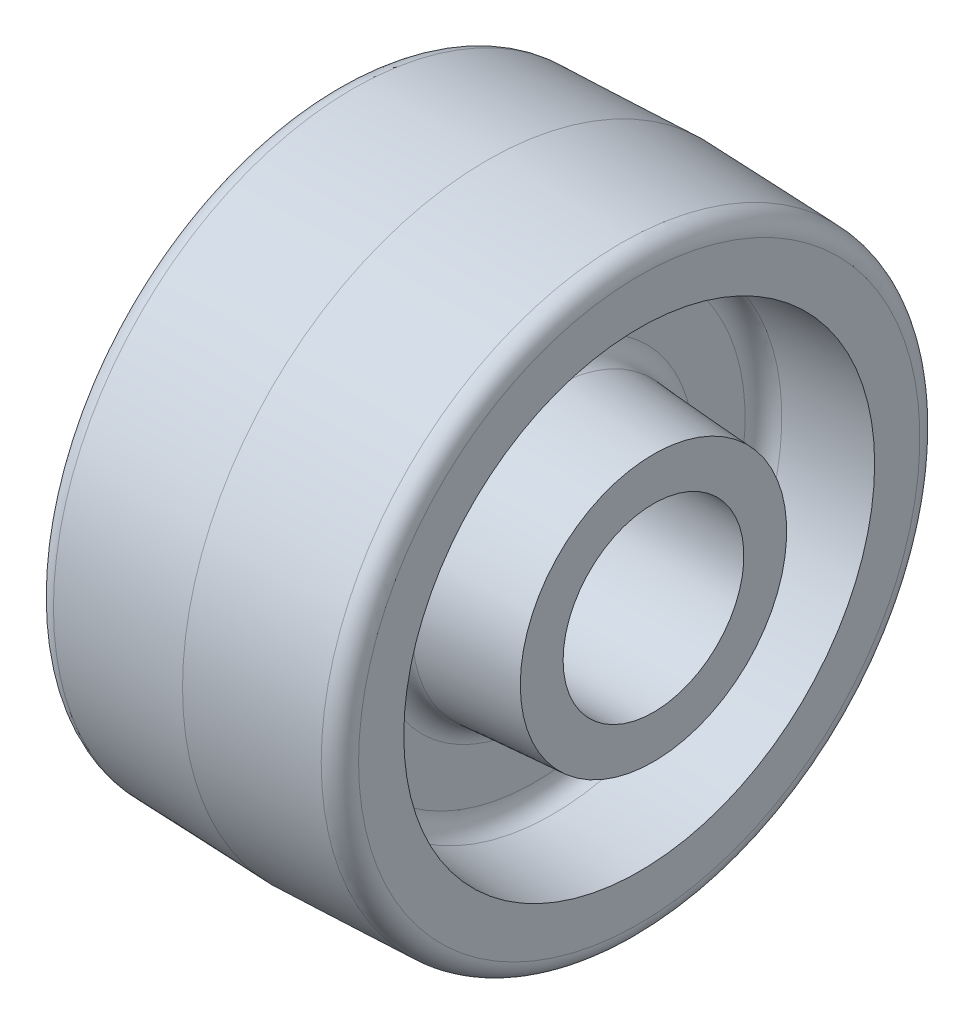
ISO-10303-21;
HEADER;
FILE_DESCRIPTION(('STEP AP214'),'2;1');
FILE_NAME('part.step','',(''),(''),'','','');
FILE_SCHEMA(('AUTOMOTIVE_DESIGN { 1 0 10303 214 1 1 1 1 }'));
ENDSEC;
DATA;
#1=APPLICATION_CONTEXT('core data for automotive mechanical design processes');
#2=APPLICATION_PROTOCOL_DEFINITION('international standard','automotive_design',2000,#1);
#3=PRODUCT_CONTEXT('',#1,'mechanical');
#4=PRODUCT('Part','Part','',(#3));
#5=PRODUCT_RELATED_PRODUCT_CATEGORY('part','',(#4));
#6=PRODUCT_DEFINITION_FORMATION('','',#4);
#7=PRODUCT_DEFINITION_CONTEXT('part definition',#1,'design');
#8=PRODUCT_DEFINITION('design','',#6,#7);
#9=PRODUCT_DEFINITION_SHAPE('','',#8);
#10=(LENGTH_UNIT() NAMED_UNIT(*) SI_UNIT(.MILLI.,.METRE.));
#11=(NAMED_UNIT(*) PLANE_ANGLE_UNIT() SI_UNIT($,.RADIAN.));
#12=(NAMED_UNIT(*) SI_UNIT($,.STERADIAN.) SOLID_ANGLE_UNIT());
#13=UNCERTAINTY_MEASURE_WITH_UNIT(LENGTH_MEASURE(1.E-05),#10,'distance_accuracy_value','');
#14=(GEOMETRIC_REPRESENTATION_CONTEXT(3) GLOBAL_UNCERTAINTY_ASSIGNED_CONTEXT((#13)) GLOBAL_UNIT_ASSIGNED_CONTEXT((#10,
#11,#12)) REPRESENTATION_CONTEXT('',''));
#15=CARTESIAN_POINT('',(0.,0.,0.));
#16=DIRECTION('',(0.,0.,1.));
#17=DIRECTION('',(1.,0.,0.));
#18=AXIS2_PLACEMENT_3D('',#15,#16,#17);
#19=CARTESIAN_POINT('',(27.78125,22.225,0.));
#20=DIRECTION('',(-1.,0.,0.));
#21=DIRECTION('',(0.,0.,1.));
#22=AXIS2_PLACEMENT_3D('',#19,#20,#21);
#23=PLANE('',#22);
#24=CARTESIAN_POINT('',(27.78125,0.,0.));
#25=DIRECTION('',(-1.,0.,0.));
#26=DIRECTION('',(0.,0.,1.));
#27=AXIS2_PLACEMENT_3D('',#24,#25,#26);
#28=CIRCLE('',#27,15.08125);
#29=CARTESIAN_POINT('',(27.78125,0.,15.08125));
#30=VERTEX_POINT('',#29);
#31=EDGE_CURVE('E89',#30,#30,#28,.F.);
#32=ORIENTED_EDGE('',*,*,#31,.F.);
#33=EDGE_LOOP('',(#32));
#34=FACE_BOUND('',#33,.T.);
#35=CARTESIAN_POINT('',(27.78125,0.,0.));
#36=DIRECTION('',(-1.,0.,0.));
#37=DIRECTION('',(0.,0.,1.));
#38=AXIS2_PLACEMENT_3D('',#35,#36,#37);
#39=CIRCLE('',#38,22.225);
#40=CARTESIAN_POINT('',(27.78125,0.,22.225));
#41=VERTEX_POINT('',#40);
#42=EDGE_CURVE('E10',#41,#41,#39,.T.);
#43=ORIENTED_EDGE('',*,*,#42,.F.);
#44=EDGE_LOOP('',(#43));
#45=FACE_BOUND('',#44,.T.);
#46=ADVANCED_FACE('F31',(#34,#45),#23,.F.);
#47=CARTESIAN_POINT('',(27.78125,0.,0.));
#48=DIRECTION('',(-1.,0.,0.));
#49=DIRECTION('',(0.,0.,1.));
#50=AXIS2_PLACEMENT_3D('',#47,#48,#49);
#51=CONICAL_SURFACE('',#50,22.225,0.0677187749773543);
#52=CARTESIAN_POINT('',(10.89765718287,0.,0.));
#53=DIRECTION('',(-1.,0.,0.));
#54=DIRECTION('',(0.,0.,1.));
#55=AXIS2_PLACEMENT_3D('',#52,#53,#54);
#56=CIRCLE('',#55,23.370087150778);
#57=CARTESIAN_POINT('',(10.89765718287,0.,23.370087150778));
#58=VERTEX_POINT('',#57);
#59=EDGE_CURVE('E38',#58,#58,#56,.T.);
#60=ORIENTED_EDGE('',*,*,#59,.F.);
#61=EDGE_LOOP('',(#60));
#62=FACE_BOUND('',#61,.T.);
#63=ORIENTED_EDGE('',*,*,#42,.T.);
#64=EDGE_LOOP('',(#63));
#65=FACE_BOUND('',#64,.T.);
#66=ADVANCED_FACE('F191',(#62,#65),#51,.T.);
#67=CARTESIAN_POINT('',(11.1125000000004,0.,0.));
#68=DIRECTION('',(-1.,0.,0.));
#69=DIRECTION('',(0.,0.,1.));
#70=AXIS2_PLACEMENT_3D('',#67,#68,#69);
#71=TOROIDAL_SURFACE('',#70,26.5378099233592,3.17500000000036);
#72=CARTESIAN_POINT('',(7.9375,0.,0.));
#73=DIRECTION('',(-1.,0.,0.));
#74=DIRECTION('',(0.,0.,1.));
#75=AXIS2_PLACEMENT_3D('',#72,#73,#74);
#76=CIRCLE('',#75,26.537809923359);
#77=CARTESIAN_POINT('',(7.9375,0.,26.537809923359));
#78=VERTEX_POINT('',#77);
#79=EDGE_CURVE('E42',#78,#78,#76,.T.);
#80=ORIENTED_EDGE('',*,*,#79,.F.);
#81=EDGE_LOOP('',(#80));
#82=FACE_BOUND('',#81,.T.);
#83=ORIENTED_EDGE('',*,*,#59,.T.);
#84=EDGE_LOOP('',(#83));
#85=FACE_BOUND('',#84,.T.);
#86=ADVANCED_FACE('F185',(#82,#85),#71,.F.);
#87=CARTESIAN_POINT('',(7.9375,35.133042431313,0.));
#88=DIRECTION('',(-1.,0.,0.));
#89=DIRECTION('',(0.,0.,1.));
#90=AXIS2_PLACEMENT_3D('',#87,#88,#89);
#91=PLANE('',#90);
#92=CARTESIAN_POINT('',(7.9375,0.,0.));
#93=DIRECTION('',(-1.,0.,0.));
#94=DIRECTION('',(0.,0.,1.));
#95=AXIS2_PLACEMENT_3D('',#92,#93,#94);
#96=CIRCLE('',#95,35.133042431313);
#97=CARTESIAN_POINT('',(7.9375,0.,35.133042431313));
#98=VERTEX_POINT('',#97);
#99=EDGE_CURVE('E47',#98,#98,#96,.T.);
#100=ORIENTED_EDGE('',*,*,#99,.F.);
#101=EDGE_LOOP('',(#100));
#102=FACE_BOUND('',#101,.T.);
#103=ORIENTED_EDGE('',*,*,#79,.T.);
#104=EDGE_LOOP('',(#103));
#105=FACE_BOUND('',#104,.T.);
#106=ADVANCED_FACE('F179',(#102,#105),#91,.F.);
#107=CARTESIAN_POINT('',(11.1125000000004,0.,0.));
#108=DIRECTION('',(-1.,0.,0.));
#109=DIRECTION('',(0.,0.,1.));
#110=AXIS2_PLACEMENT_3D('',#107,#108,#109);
#111=TOROIDAL_SURFACE('',#110,35.1330424313128,3.17500000000036);
#112=CARTESIAN_POINT('',(10.89765718287,0.,0.));
#113=DIRECTION('',(-1.,0.,0.));
#114=DIRECTION('',(0.,0.,1.));
#115=AXIS2_PLACEMENT_3D('',#112,#113,#114);
#116=CIRCLE('',#115,38.300765203894);
#117=CARTESIAN_POINT('',(10.89765718287,0.,38.300765203894));
#118=VERTEX_POINT('',#117);
#119=EDGE_CURVE('E50',#118,#118,#116,.T.);
#120=ORIENTED_EDGE('',*,*,#119,.F.);
#121=EDGE_LOOP('',(#120));
#122=FACE_BOUND('',#121,.T.);
#123=ORIENTED_EDGE('',*,*,#99,.T.);
#124=EDGE_LOOP('',(#123));
#125=FACE_BOUND('',#124,.T.);
#126=ADVANCED_FACE('F173',(#122,#125),#111,.F.);
#127=CARTESIAN_POINT('',(10.89765718287,0.,0.));
#128=DIRECTION('',(1.,0.,0.));
#129=DIRECTION('',(0.,0.,-1.));
#130=AXIS2_PLACEMENT_3D('',#127,#128,#129);
#131=CONICAL_SURFACE('',#130,38.300765203894,0.0677187749773266);
#132=CARTESIAN_POINT('',(25.4,0.,0.));
#133=DIRECTION('',(-1.,0.,0.));
#134=DIRECTION('',(0.,0.,1.));
#135=AXIS2_PLACEMENT_3D('',#132,#133,#134);
#136=CIRCLE('',#135,39.284350072111);
#137=CARTESIAN_POINT('',(25.4,0.,39.284350072111));
#138=VERTEX_POINT('',#137);
#139=EDGE_CURVE('E53',#138,#138,#136,.T.);
#140=ORIENTED_EDGE('',*,*,#139,.F.);
#141=EDGE_LOOP('',(#140));
#142=FACE_BOUND('',#141,.T.);
#143=ORIENTED_EDGE('',*,*,#119,.T.);
#144=EDGE_LOOP('',(#143));
#145=FACE_BOUND('',#144,.T.);
#146=ADVANCED_FACE('F167',(#142,#145),#131,.F.);
#147=CARTESIAN_POINT('',(25.4,46.827433348469,0.));
#148=DIRECTION('',(-1.,0.,0.));
#149=DIRECTION('',(0.,0.,1.));
#150=AXIS2_PLACEMENT_3D('',#147,#148,#149);
#151=PLANE('',#150);
#152=CARTESIAN_POINT('',(25.4,0.,0.));
#153=DIRECTION('',(-1.,0.,0.));
#154=DIRECTION('',(0.,0.,1.));
#155=AXIS2_PLACEMENT_3D('',#152,#153,#154);
#156=CIRCLE('',#155,46.827433348469);
#157=CARTESIAN_POINT('',(25.4,0.,46.827433348469));
#158=VERTEX_POINT('',#157);
#159=EDGE_CURVE('E56',#158,#158,#156,.T.);
#160=ORIENTED_EDGE('',*,*,#159,.F.);
#161=EDGE_LOOP('',(#160));
#162=FACE_BOUND('',#161,.T.);
#163=ORIENTED_EDGE('',*,*,#139,.T.);
#164=EDGE_LOOP('',(#163));
#165=FACE_BOUND('',#164,.T.);
#166=ADVANCED_FACE('F161',(#162,#165),#151,.F.);
#167=CARTESIAN_POINT('',(22.2249999999989,0.,0.));
#168=DIRECTION('',(-1.,0.,0.));
#169=DIRECTION('',(0.,0.,1.));
#170=AXIS2_PLACEMENT_3D('',#167,#168,#169);
#171=TOROIDAL_SURFACE('',#170,46.8274333484679,3.1750000000011);
#172=CARTESIAN_POINT('',(22.338574881833,0.,0.));
#173=DIRECTION('',(-1.,0.,0.));
#174=DIRECTION('',(0.,0.,1.));
#175=AXIS2_PLACEMENT_3D('',#172,#173,#174);
#176=CIRCLE('',#175,50.000401319662);
#177=CARTESIAN_POINT('',(22.338574881833,0.,50.000401319662));
#178=VERTEX_POINT('',#177);
#179=EDGE_CURVE('E59',#178,#178,#176,.T.);
#180=ORIENTED_EDGE('',*,*,#179,.F.);
#181=EDGE_LOOP('',(#180));
#182=FACE_BOUND('',#181,.T.);
#183=ORIENTED_EDGE('',*,*,#159,.T.);
#184=EDGE_LOOP('',(#183));
#185=FACE_BOUND('',#184,.T.);
#186=ADVANCED_FACE('F155',(#182,#185),#171,.T.);
#187=CARTESIAN_POINT('',(22.338574881833,0.,0.));
#188=DIRECTION('',(-1.,0.,0.));
#189=DIRECTION('',(0.,0.,1.));
#190=AXIS2_PLACEMENT_3D('',#187,#188,#189);
#191=CONICAL_SURFACE('',#190,50.000401319662,0.0357792496658724);
#192=CARTESIAN_POINT('',(0.,0.,0.));
#193=DIRECTION('',(-1.,0.,0.));
#194=DIRECTION('',(0.,0.,1.));
#195=AXIS2_PLACEMENT_3D('',#192,#193,#194);
#196=CIRCLE('',#195,50.8);
#197=CARTESIAN_POINT('',(0.,0.,50.8));
#198=VERTEX_POINT('',#197);
#199=EDGE_CURVE('E62',#198,#198,#196,.T.);
#200=ORIENTED_EDGE('',*,*,#199,.F.);
#201=EDGE_LOOP('',(#200));
#202=FACE_BOUND('',#201,.T.);
#203=ORIENTED_EDGE('',*,*,#179,.T.);
#204=EDGE_LOOP('',(#203));
#205=FACE_BOUND('',#204,.T.);
#206=ADVANCED_FACE('F149',(#202,#205),#191,.T.);
#207=CARTESIAN_POINT('',(0.,0.,0.));
#208=DIRECTION('',(1.,0.,0.));
#209=DIRECTION('',(0.,0.,-1.));
#210=AXIS2_PLACEMENT_3D('',#207,#208,#209);
#211=CONICAL_SURFACE('',#210,50.8,0.0357792496658724);
#212=CARTESIAN_POINT('',(-22.338574881833,0.,0.));
#213=DIRECTION('',(-1.,0.,0.));
#214=DIRECTION('',(0.,0.,1.));
#215=AXIS2_PLACEMENT_3D('',#212,#213,#214);
#216=CIRCLE('',#215,50.000401319662);
#217=CARTESIAN_POINT('',(-22.338574881833,0.,50.000401319662));
#218=VERTEX_POINT('',#217);
#219=EDGE_CURVE('E65',#218,#218,#216,.T.);
#220=ORIENTED_EDGE('',*,*,#219,.F.);
#221=EDGE_LOOP('',(#220));
#222=FACE_BOUND('',#221,.T.);
#223=ORIENTED_EDGE('',*,*,#199,.T.);
#224=EDGE_LOOP('',(#223));
#225=FACE_BOUND('',#224,.T.);
#226=ADVANCED_FACE('F143',(#222,#225),#211,.T.);
#227=CARTESIAN_POINT('',(-22.2249999999989,0.,0.));
#228=DIRECTION('',(-1.,0.,0.));
#229=DIRECTION('',(0.,0.,1.));
#230=AXIS2_PLACEMENT_3D('',#227,#228,#229);
#231=TOROIDAL_SURFACE('',#230,46.8274333484679,3.1750000000011);
#232=CARTESIAN_POINT('',(-25.4,0.,0.));
#233=DIRECTION('',(-1.,0.,0.));
#234=DIRECTION('',(0.,0.,1.));
#235=AXIS2_PLACEMENT_3D('',#232,#233,#234);
#236=CIRCLE('',#235,46.827433348469);
#237=CARTESIAN_POINT('',(-25.4,0.,46.827433348469));
#238=VERTEX_POINT('',#237);
#239=EDGE_CURVE('E68',#238,#238,#236,.T.);
#240=ORIENTED_EDGE('',*,*,#239,.F.);
#241=EDGE_LOOP('',(#240));
#242=FACE_BOUND('',#241,.T.);
#243=ORIENTED_EDGE('',*,*,#219,.T.);
#244=EDGE_LOOP('',(#243));
#245=FACE_BOUND('',#244,.T.);
#246=ADVANCED_FACE('F137',(#242,#245),#231,.T.);
#247=CARTESIAN_POINT('',(-25.4,39.284350072111,0.));
#248=DIRECTION('',(1.,0.,0.));
#249=DIRECTION('',(0.,0.,-1.));
#250=AXIS2_PLACEMENT_3D('',#247,#248,#249);
#251=PLANE('',#250);
#252=CARTESIAN_POINT('',(-25.4,0.,0.));
#253=DIRECTION('',(-1.,0.,0.));
#254=DIRECTION('',(0.,0.,1.));
#255=AXIS2_PLACEMENT_3D('',#252,#253,#254);
#256=CIRCLE('',#255,39.284350072111);
#257=CARTESIAN_POINT('',(-25.4,0.,39.284350072111));
#258=VERTEX_POINT('',#257);
#259=EDGE_CURVE('E71',#258,#258,#256,.T.);
#260=ORIENTED_EDGE('',*,*,#259,.F.);
#261=EDGE_LOOP('',(#260));
#262=FACE_BOUND('',#261,.T.);
#263=ORIENTED_EDGE('',*,*,#239,.T.);
#264=EDGE_LOOP('',(#263));
#265=FACE_BOUND('',#264,.T.);
#266=ADVANCED_FACE('F131',(#262,#265),#251,.F.);
#267=CARTESIAN_POINT('',(-25.4,0.,0.));
#268=DIRECTION('',(-1.,0.,0.));
#269=DIRECTION('',(0.,0.,1.));
#270=AXIS2_PLACEMENT_3D('',#267,#268,#269);
#271=CONICAL_SURFACE('',#270,39.284350072111,0.0677187749773266);
#272=CARTESIAN_POINT('',(-10.89765718287,0.,0.));
#273=DIRECTION('',(-1.,0.,0.));
#274=DIRECTION('',(0.,0.,1.));
#275=AXIS2_PLACEMENT_3D('',#272,#273,#274);
#276=CIRCLE('',#275,38.300765203894);
#277=CARTESIAN_POINT('',(-10.89765718287,0.,38.300765203894));
#278=VERTEX_POINT('',#277);
#279=EDGE_CURVE('E74',#278,#278,#276,.T.);
#280=ORIENTED_EDGE('',*,*,#279,.F.);
#281=EDGE_LOOP('',(#280));
#282=FACE_BOUND('',#281,.T.);
#283=ORIENTED_EDGE('',*,*,#259,.T.);
#284=EDGE_LOOP('',(#283));
#285=FACE_BOUND('',#284,.T.);
#286=ADVANCED_FACE('F125',(#282,#285),#271,.F.);
#287=CARTESIAN_POINT('',(-11.1125000000004,0.,0.));
#288=DIRECTION('',(-1.,0.,0.));
#289=DIRECTION('',(0.,0.,1.));
#290=AXIS2_PLACEMENT_3D('',#287,#288,#289);
#291=TOROIDAL_SURFACE('',#290,35.1330424313128,3.17500000000036);
#292=CARTESIAN_POINT('',(-7.9375,0.,0.));
#293=DIRECTION('',(-1.,0.,0.));
#294=DIRECTION('',(0.,0.,1.));
#295=AXIS2_PLACEMENT_3D('',#292,#293,#294);
#296=CIRCLE('',#295,35.133042431313);
#297=CARTESIAN_POINT('',(-7.9375,0.,35.133042431313));
#298=VERTEX_POINT('',#297);
#299=EDGE_CURVE('E77',#298,#298,#296,.T.);
#300=ORIENTED_EDGE('',*,*,#299,.F.);
#301=EDGE_LOOP('',(#300));
#302=FACE_BOUND('',#301,.T.);
#303=ORIENTED_EDGE('',*,*,#279,.T.);
#304=EDGE_LOOP('',(#303));
#305=FACE_BOUND('',#304,.T.);
#306=ADVANCED_FACE('F119',(#302,#305),#291,.F.);
#307=CARTESIAN_POINT('',(-7.9375,26.537809923359,0.));
#308=DIRECTION('',(1.,0.,0.));
#309=DIRECTION('',(0.,0.,-1.));
#310=AXIS2_PLACEMENT_3D('',#307,#308,#309);
#311=PLANE('',#310);
#312=CARTESIAN_POINT('',(-7.9375,0.,0.));
#313=DIRECTION('',(-1.,0.,0.));
#314=DIRECTION('',(0.,0.,1.));
#315=AXIS2_PLACEMENT_3D('',#312,#313,#314);
#316=CIRCLE('',#315,26.537809923359);
#317=CARTESIAN_POINT('',(-7.9375,0.,26.537809923359));
#318=VERTEX_POINT('',#317);
#319=EDGE_CURVE('E80',#318,#318,#316,.T.);
#320=ORIENTED_EDGE('',*,*,#319,.F.);
#321=EDGE_LOOP('',(#320));
#322=FACE_BOUND('',#321,.T.);
#323=ORIENTED_EDGE('',*,*,#299,.T.);
#324=EDGE_LOOP('',(#323));
#325=FACE_BOUND('',#324,.T.);
#326=ADVANCED_FACE('F113',(#322,#325),#311,.F.);
#327=CARTESIAN_POINT('',(-11.1125000000004,0.,0.));
#328=DIRECTION('',(-1.,0.,0.));
#329=DIRECTION('',(0.,0.,1.));
#330=AXIS2_PLACEMENT_3D('',#327,#328,#329);
#331=TOROIDAL_SURFACE('',#330,26.5378099233592,3.17500000000037);
#332=CARTESIAN_POINT('',(-10.89765718287,0.,0.));
#333=DIRECTION('',(-1.,0.,0.));
#334=DIRECTION('',(0.,0.,1.));
#335=AXIS2_PLACEMENT_3D('',#332,#333,#334);
#336=CIRCLE('',#335,23.370087150778);
#337=CARTESIAN_POINT('',(-10.89765718287,0.,23.370087150778));
#338=VERTEX_POINT('',#337);
#339=EDGE_CURVE('E83',#338,#338,#336,.T.);
#340=ORIENTED_EDGE('',*,*,#339,.F.);
#341=EDGE_LOOP('',(#340));
#342=FACE_BOUND('',#341,.T.);
#343=ORIENTED_EDGE('',*,*,#319,.T.);
#344=EDGE_LOOP('',(#343));
#345=FACE_BOUND('',#344,.T.);
#346=ADVANCED_FACE('F107',(#342,#345),#331,.F.);
#347=CARTESIAN_POINT('',(-10.89765718287,0.,0.));
#348=DIRECTION('',(1.,0.,0.));
#349=DIRECTION('',(0.,0.,-1.));
#350=AXIS2_PLACEMENT_3D('',#347,#348,#349);
#351=CONICAL_SURFACE('',#350,23.370087150778,0.0677187749773543);
#352=CARTESIAN_POINT('',(-27.78125,0.,0.));
#353=DIRECTION('',(-1.,0.,0.));
#354=DIRECTION('',(0.,0.,1.));
#355=AXIS2_PLACEMENT_3D('',#352,#353,#354);
#356=CIRCLE('',#355,22.225);
#357=CARTESIAN_POINT('',(-27.78125,0.,22.225));
#358=VERTEX_POINT('',#357);
#359=EDGE_CURVE('E86',#358,#358,#356,.T.);
#360=ORIENTED_EDGE('',*,*,#359,.F.);
#361=EDGE_LOOP('',(#360));
#362=FACE_BOUND('',#361,.T.);
#363=ORIENTED_EDGE('',*,*,#339,.T.);
#364=EDGE_LOOP('',(#363));
#365=FACE_BOUND('',#364,.T.);
#366=ADVANCED_FACE('F101',(#362,#365),#351,.T.);
#367=CARTESIAN_POINT('',(-27.78125,0.,0.));
#368=DIRECTION('',(1.,0.,0.));
#369=DIRECTION('',(0.,0.,-1.));
#370=AXIS2_PLACEMENT_3D('',#367,#368,#369);
#371=PLANE('',#370);
#372=CARTESIAN_POINT('',(-27.78125,0.,0.));
#373=DIRECTION('',(1.,0.,0.));
#374=DIRECTION('',(0.,0.,-1.));
#375=AXIS2_PLACEMENT_3D('',#372,#373,#374);
#376=CIRCLE('',#375,15.08125);
#377=CARTESIAN_POINT('',(-27.78125,0.,-15.08125));
#378=VERTEX_POINT('',#377);
#379=EDGE_CURVE('E34',#378,#378,#376,.F.);
#380=ORIENTED_EDGE('',*,*,#379,.F.);
#381=EDGE_LOOP('',(#380));
#382=FACE_BOUND('',#381,.T.);
#383=ORIENTED_EDGE('',*,*,#359,.T.);
#384=EDGE_LOOP('',(#383));
#385=FACE_BOUND('',#384,.T.);
#386=ADVANCED_FACE('F98',(#382,#385),#371,.F.);
#387=CARTESIAN_POINT('',(30.559375,0.,0.));
#388=DIRECTION('',(-1.,0.,0.));
#389=DIRECTION('',(0.,0.,1.));
#390=AXIS2_PLACEMENT_3D('',#387,#388,#389);
#391=CYLINDRICAL_SURFACE('',#390,15.08125);
#392=ORIENTED_EDGE('',*,*,#379,.T.);
#393=EDGE_LOOP('',(#392));
#394=FACE_BOUND('',#393,.T.);
#395=ORIENTED_EDGE('',*,*,#31,.T.);
#396=EDGE_LOOP('',(#395));
#397=FACE_BOUND('',#396,.T.);
#398=ADVANCED_FACE('F96',(#394,#397),#391,.F.);
#399=CLOSED_SHELL('',(#46,#66,#86,#106,#126,#146,#166,#186,#206,#226,#246,#266,#286,#306,#326,
#346,#366,#386,#398));
#400=MANIFOLD_SOLID_BREP('B2',#399);
#401=ADVANCED_BREP_SHAPE_REPRESENTATION('',(#18,#400),#14);
#402=SHAPE_DEFINITION_REPRESENTATION(#9,#401);
ENDSEC;
END-ISO-10303-21;
